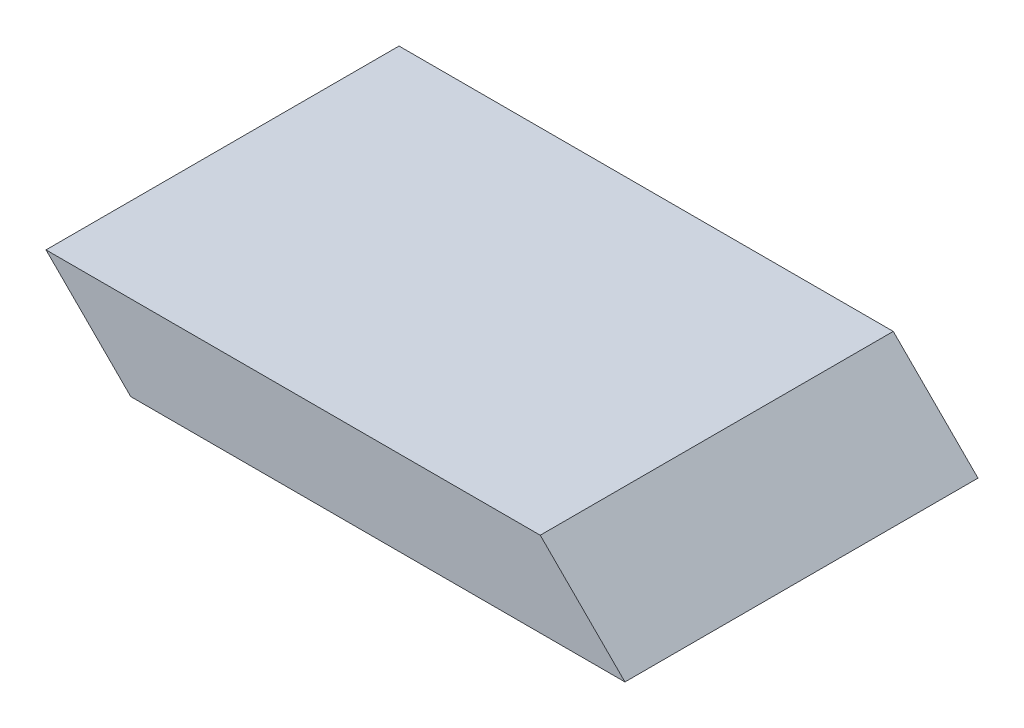
ISO-10303-21;
HEADER;
FILE_DESCRIPTION(('STEP AP214'),'2;1');
FILE_NAME('part.step','',(''),(''),'','','');
FILE_SCHEMA(('AUTOMOTIVE_DESIGN { 1 0 10303 214 1 1 1 1 }'));
ENDSEC;
DATA;
#1=APPLICATION_CONTEXT('core data for automotive mechanical design processes');
#2=APPLICATION_PROTOCOL_DEFINITION('international standard','automotive_design',2000,#1);
#3=PRODUCT_CONTEXT('',#1,'mechanical');
#4=PRODUCT('Part','Part','',(#3));
#5=PRODUCT_RELATED_PRODUCT_CATEGORY('part','',(#4));
#6=PRODUCT_DEFINITION_FORMATION('','',#4);
#7=PRODUCT_DEFINITION_CONTEXT('part definition',#1,'design');
#8=PRODUCT_DEFINITION('design','',#6,#7);
#9=PRODUCT_DEFINITION_SHAPE('','',#8);
#10=(LENGTH_UNIT() NAMED_UNIT(*) SI_UNIT(.MILLI.,.METRE.));
#11=(NAMED_UNIT(*) PLANE_ANGLE_UNIT() SI_UNIT($,.RADIAN.));
#12=(NAMED_UNIT(*) SI_UNIT($,.STERADIAN.) SOLID_ANGLE_UNIT());
#13=UNCERTAINTY_MEASURE_WITH_UNIT(LENGTH_MEASURE(1.E-05),#10,'distance_accuracy_value','');
#14=(GEOMETRIC_REPRESENTATION_CONTEXT(3) GLOBAL_UNCERTAINTY_ASSIGNED_CONTEXT((#13)) GLOBAL_UNIT_ASSIGNED_CONTEXT((#10,
#11,#12)) REPRESENTATION_CONTEXT('',''));
#15=CARTESIAN_POINT('',(0.,0.,0.));
#16=DIRECTION('',(0.,0.,1.));
#17=DIRECTION('',(1.,0.,0.));
#18=AXIS2_PLACEMENT_3D('',#15,#16,#17);
#19=CARTESIAN_POINT('',(-44.45,15.24,-31.75));
#20=DIRECTION('',(0.,0.,1.));
#21=DIRECTION('',(1.,0.,0.));
#22=AXIS2_PLACEMENT_3D('',#19,#20,#21);
#23=PLANE('',#22);
#24=DIRECTION('',(-1.,0.,0.));
#25=VECTOR('',#24,1.);
#26=CARTESIAN_POINT('',(-44.45,0.,-31.75));
#27=LINE('',#26,#25);
#28=CARTESIAN_POINT('',(59.6900000000002,0.,-31.75));
#29=VERTEX_POINT('',#28);
#30=CARTESIAN_POINT('',(-29.2099999999998,0.,-31.75));
#31=VERTEX_POINT('',#30);
#32=EDGE_CURVE('E81',#29,#31,#27,.T.);
#33=ORIENTED_EDGE('',*,*,#32,.T.);
#34=DIRECTION('',(0.707106781186551,-0.707106781186544,0.));
#35=VECTOR('',#34,1.);
#36=CARTESIAN_POINT('',(-44.45,15.24,-31.75));
#37=LINE('',#36,#35);
#38=CARTESIAN_POINT('',(-44.45,15.24,-31.75));
#39=VERTEX_POINT('',#38);
#40=EDGE_CURVE('E49',#39,#31,#37,.T.);
#41=ORIENTED_EDGE('',*,*,#40,.F.);
#42=DIRECTION('',(-1.,0.,0.));
#43=VECTOR('',#42,1.);
#44=CARTESIAN_POINT('',(-44.45,15.24,-31.75));
#45=LINE('',#44,#43);
#46=CARTESIAN_POINT('',(44.45,15.24,-31.75));
#47=VERTEX_POINT('',#46);
#48=EDGE_CURVE('E76',#47,#39,#45,.T.);
#49=ORIENTED_EDGE('',*,*,#48,.F.);
#50=DIRECTION('',(0.707106781186551,-0.707106781186544,0.));
#51=VECTOR('',#50,1.);
#52=CARTESIAN_POINT('',(44.45,15.24,-31.75));
#53=LINE('',#52,#51);
#54=EDGE_CURVE('E90',#47,#29,#53,.T.);
#55=ORIENTED_EDGE('',*,*,#54,.T.);
#56=EDGE_LOOP('',(#33,#41,#49,#55));
#57=FACE_BOUND('',#56,.T.);
#58=ADVANCED_FACE('F33',(#57),#23,.F.);
#59=CARTESIAN_POINT('',(-44.45,15.24,31.75));
#60=DIRECTION('',(0.,0.,-1.));
#61=DIRECTION('',(-1.,0.,0.));
#62=AXIS2_PLACEMENT_3D('',#59,#60,#61);
#63=PLANE('',#62);
#64=DIRECTION('',(1.,0.,0.));
#65=VECTOR('',#64,1.);
#66=CARTESIAN_POINT('',(-44.45,15.24,31.75));
#67=LINE('',#66,#65);
#68=CARTESIAN_POINT('',(-44.45,15.24,31.75));
#69=VERTEX_POINT('',#68);
#70=CARTESIAN_POINT('',(44.45,15.24,31.75));
#71=VERTEX_POINT('',#70);
#72=EDGE_CURVE('E11',#69,#71,#67,.T.);
#73=ORIENTED_EDGE('',*,*,#72,.F.);
#74=DIRECTION('',(-0.707106781186551,0.707106781186544,0.));
#75=VECTOR('',#74,1.);
#76=CARTESIAN_POINT('',(-44.45,15.24,31.75));
#77=LINE('',#76,#75);
#78=CARTESIAN_POINT('',(-29.2099999999998,0.,31.75));
#79=VERTEX_POINT('',#78);
#80=EDGE_CURVE('E74',#79,#69,#77,.T.);
#81=ORIENTED_EDGE('',*,*,#80,.F.);
#82=DIRECTION('',(1.,0.,0.));
#83=VECTOR('',#82,1.);
#84=CARTESIAN_POINT('',(-44.45,0.,31.75));
#85=LINE('',#84,#83);
#86=CARTESIAN_POINT('',(59.6900000000002,0.,31.75));
#87=VERTEX_POINT('',#86);
#88=EDGE_CURVE('E36',#79,#87,#85,.T.);
#89=ORIENTED_EDGE('',*,*,#88,.T.);
#90=DIRECTION('',(-0.707106781186551,0.707106781186544,0.));
#91=VECTOR('',#90,1.);
#92=CARTESIAN_POINT('',(44.45,15.24,31.75));
#93=LINE('',#92,#91);
#94=EDGE_CURVE('E95',#87,#71,#93,.T.);
#95=ORIENTED_EDGE('',*,*,#94,.T.);
#96=EDGE_LOOP('',(#73,#81,#89,#95));
#97=FACE_BOUND('',#96,.T.);
#98=ADVANCED_FACE('F105',(#97),#63,.F.);
#99=CARTESIAN_POINT('',(0.,15.24,0.));
#100=DIRECTION('',(0.,1.,0.));
#101=DIRECTION('',(0.,0.,1.));
#102=AXIS2_PLACEMENT_3D('',#99,#100,#101);
#103=PLANE('',#102);
#104=DIRECTION('',(0.,0.,-1.));
#105=VECTOR('',#104,1.);
#106=CARTESIAN_POINT('',(44.45,15.24,-31.75));
#107=LINE('',#106,#105);
#108=EDGE_CURVE('E85',#71,#47,#107,.T.);
#109=ORIENTED_EDGE('',*,*,#108,.T.);
#110=ORIENTED_EDGE('',*,*,#48,.T.);
#111=DIRECTION('',(0.,0.,1.));
#112=VECTOR('',#111,1.);
#113=CARTESIAN_POINT('',(-44.45,15.24,-31.75));
#114=LINE('',#113,#112);
#115=EDGE_CURVE('E41',#39,#69,#114,.T.);
#116=ORIENTED_EDGE('',*,*,#115,.T.);
#117=ORIENTED_EDGE('',*,*,#72,.T.);
#118=EDGE_LOOP('',(#109,#110,#116,#117));
#119=FACE_BOUND('',#118,.T.);
#120=ADVANCED_FACE('F84',(#119),#103,.T.);
#121=CARTESIAN_POINT('',(0.,0.,0.));
#122=DIRECTION('',(0.,1.,0.));
#123=DIRECTION('',(0.,0.,1.));
#124=AXIS2_PLACEMENT_3D('',#121,#122,#123);
#125=PLANE('',#124);
#126=ORIENTED_EDGE('',*,*,#88,.F.);
#127=DIRECTION('',(0.,0.,-1.));
#128=VECTOR('',#127,1.);
#129=CARTESIAN_POINT('',(-29.2099999999998,0.,53.302614690566));
#130=LINE('',#129,#128);
#131=EDGE_CURVE('E82',#79,#31,#130,.T.);
#132=ORIENTED_EDGE('',*,*,#131,.T.);
#133=ORIENTED_EDGE('',*,*,#32,.F.);
#134=DIRECTION('',(0.,0.,1.));
#135=VECTOR('',#134,1.);
#136=CARTESIAN_POINT('',(59.6900000000002,0.,-53.302614690566));
#137=LINE('',#136,#135);
#138=EDGE_CURVE('E91',#29,#87,#137,.T.);
#139=ORIENTED_EDGE('',*,*,#138,.T.);
#140=EDGE_LOOP('',(#126,#132,#133,#139));
#141=FACE_BOUND('',#140,.T.);
#142=ADVANCED_FACE('F104',(#141),#125,.F.);
#143=CARTESIAN_POINT('',(44.45,15.24,-53.302614690566));
#144=DIRECTION('',(0.707106781186544,0.707106781186551,0.));
#145=DIRECTION('',(-0.707106781186551,0.707106781186544,0.));
#146=AXIS2_PLACEMENT_3D('',#143,#144,#145);
#147=PLANE('',#146);
#148=ORIENTED_EDGE('',*,*,#54,.F.);
#149=ORIENTED_EDGE('',*,*,#108,.F.);
#150=ORIENTED_EDGE('',*,*,#94,.F.);
#151=ORIENTED_EDGE('',*,*,#138,.F.);
#152=EDGE_LOOP('',(#148,#149,#150,#151));
#153=FACE_BOUND('',#152,.T.);
#154=ADVANCED_FACE('F107',(#153),#147,.T.);
#155=CARTESIAN_POINT('',(-44.45,15.24,53.302614690566));
#156=DIRECTION('',(0.707106781186544,0.707106781186551,0.));
#157=DIRECTION('',(-0.707106781186551,0.707106781186544,0.));
#158=AXIS2_PLACEMENT_3D('',#155,#156,#157);
#159=PLANE('',#158);
#160=ORIENTED_EDGE('',*,*,#80,.T.);
#161=ORIENTED_EDGE('',*,*,#115,.F.);
#162=ORIENTED_EDGE('',*,*,#40,.T.);
#163=ORIENTED_EDGE('',*,*,#131,.F.);
#164=EDGE_LOOP('',(#160,#161,#162,#163));
#165=FACE_BOUND('',#164,.T.);
#166=ADVANCED_FACE('F72',(#165),#159,.F.);
#167=CLOSED_SHELL('',(#58,#98,#120,#142,#154,#166));
#168=MANIFOLD_SOLID_BREP('B2',#167);
#169=ADVANCED_BREP_SHAPE_REPRESENTATION('',(#18,#168),#14);
#170=SHAPE_DEFINITION_REPRESENTATION(#9,#169);
ENDSEC;
END-ISO-10303-21;
